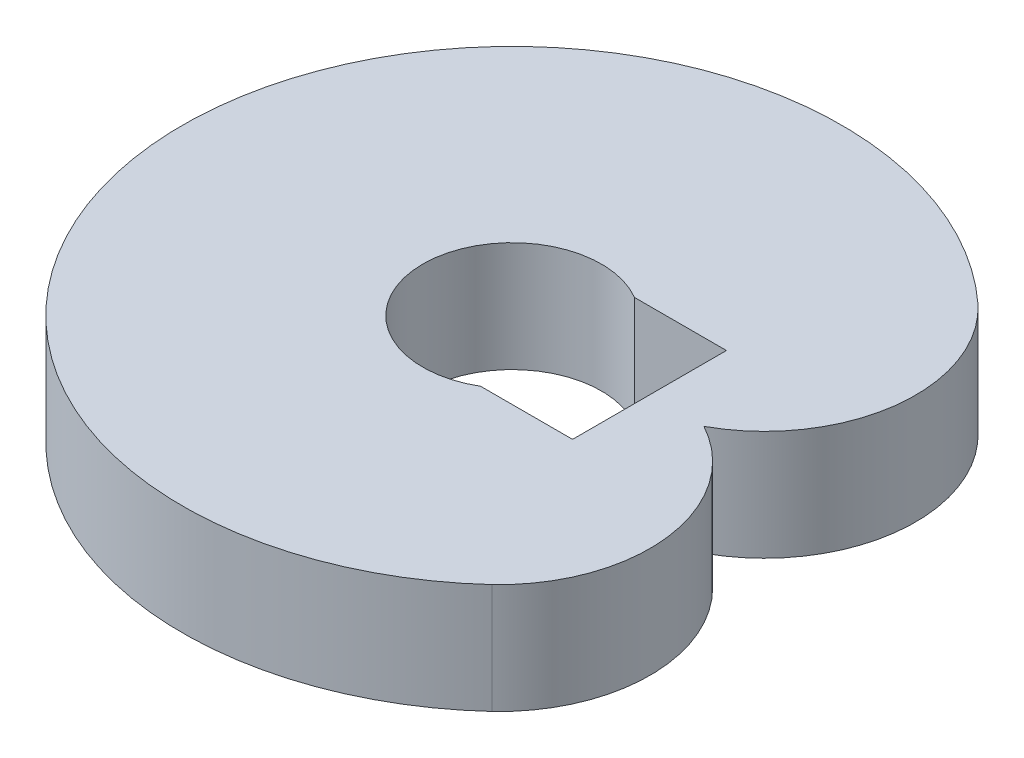
ISO-10303-21;
HEADER;
FILE_DESCRIPTION(('STEP AP214'),'2;1');
FILE_NAME('part.step','',(''),(''),'','','');
FILE_SCHEMA(('AUTOMOTIVE_DESIGN { 1 0 10303 214 1 1 1 1 }'));
ENDSEC;
DATA;
#1=APPLICATION_CONTEXT('core data for automotive mechanical design processes');
#2=APPLICATION_PROTOCOL_DEFINITION('international standard','automotive_design',2000,#1);
#3=PRODUCT_CONTEXT('',#1,'mechanical');
#4=PRODUCT('Part','Part','',(#3));
#5=PRODUCT_RELATED_PRODUCT_CATEGORY('part','',(#4));
#6=PRODUCT_DEFINITION_FORMATION('','',#4);
#7=PRODUCT_DEFINITION_CONTEXT('part definition',#1,'design');
#8=PRODUCT_DEFINITION('design','',#6,#7);
#9=PRODUCT_DEFINITION_SHAPE('','',#8);
#10=(LENGTH_UNIT() NAMED_UNIT(*) SI_UNIT(.MILLI.,.METRE.));
#11=(NAMED_UNIT(*) PLANE_ANGLE_UNIT() SI_UNIT($,.RADIAN.));
#12=(NAMED_UNIT(*) SI_UNIT($,.STERADIAN.) SOLID_ANGLE_UNIT());
#13=UNCERTAINTY_MEASURE_WITH_UNIT(LENGTH_MEASURE(1.E-05),#10,'distance_accuracy_value','');
#14=(GEOMETRIC_REPRESENTATION_CONTEXT(3) GLOBAL_UNCERTAINTY_ASSIGNED_CONTEXT((#13)) GLOBAL_UNIT_ASSIGNED_CONTEXT((#10,
#11,#12)) REPRESENTATION_CONTEXT('',''));
#15=CARTESIAN_POINT('',(0.,0.,0.));
#16=DIRECTION('',(0.,0.,1.));
#17=DIRECTION('',(1.,0.,0.));
#18=AXIS2_PLACEMENT_3D('',#15,#16,#17);
#19=CARTESIAN_POINT('',(108.7337235333,0.,-120.7610341401));
#20=DIRECTION('',(0.,1.,0.));
#21=DIRECTION('',(0.,0.,1.));
#22=AXIS2_PLACEMENT_3D('',#19,#20,#21);
#23=PLANE('',#22);
#24=CARTESIAN_POINT('',(0.,0.,-1.110223024625E-13));
#25=DIRECTION('',(0.,1.,0.));
#26=DIRECTION('',(0.,0.,1.));
#27=AXIS2_PLACEMENT_3D('',#24,#25,#26);
#28=CIRCLE('',#27,600.);
#29=CARTESIAN_POINT('',(405.732526187912,0.,-442.019362916575));
#30=VERTEX_POINT('',#29);
#31=CARTESIAN_POINT('',(405.732526187905,0.,442.019362916582));
#32=VERTEX_POINT('',#31);
#33=EDGE_CURVE('E136',#30,#32,#28,.T.);
#34=ORIENTED_EDGE('',*,*,#33,.F.);
#35=CARTESIAN_POINT('',(217.4674470666,0.,-241.5220682802));
#36=DIRECTION('',(0.,1.,0.));
#37=DIRECTION('',(0.,0.,1.));
#38=AXIS2_PLACEMENT_3D('',#35,#36,#37);
#39=CIRCLE('',#38,275.0325529334);
#40=CARTESIAN_POINT('',(349.034903934634,0.,-8.54871728961371E-12));
#41=VERTEX_POINT('',#40);
#42=EDGE_CURVE('E139',#41,#30,#39,.T.);
#43=ORIENTED_EDGE('',*,*,#42,.F.);
#44=CARTESIAN_POINT('',(217.4674470666,0.,241.5220682802));
#45=DIRECTION('',(0.,1.,0.));
#46=DIRECTION('',(0.,0.,1.));
#47=AXIS2_PLACEMENT_3D('',#44,#45,#46);
#48=CIRCLE('',#47,275.0325529334);
#49=EDGE_CURVE('E141',#32,#41,#48,.T.);
#50=ORIENTED_EDGE('',*,*,#49,.F.);
#51=EDGE_LOOP('',(#34,#43,#50));
#52=FACE_BOUND('',#51,.T.);
#53=CARTESIAN_POINT('',(0.,0.,0.));
#54=DIRECTION('',(0.,1.,0.));
#55=DIRECTION('',(0.,0.,1.));
#56=AXIS2_PLACEMENT_3D('',#53,#54,#55);
#57=CIRCLE('',#56,162.6);
#58=CARTESIAN_POINT('',(82.6967955848363,0.,-140.));
#59=VERTEX_POINT('',#58);
#60=CARTESIAN_POINT('',(82.696795584836,0.,140.));
#61=VERTEX_POINT('',#60);
#62=EDGE_CURVE('E20',#59,#61,#57,.T.);
#63=ORIENTED_EDGE('',*,*,#62,.T.);
#64=DIRECTION('',(-1.,0.,0.));
#65=VECTOR('',#64,1.);
#66=CARTESIAN_POINT('',(82.69679558484,0.,140.));
#67=LINE('',#66,#65);
#68=CARTESIAN_POINT('',(250.,0.,140.));
#69=VERTEX_POINT('',#68);
#70=EDGE_CURVE('E96',#69,#61,#67,.T.);
#71=ORIENTED_EDGE('',*,*,#70,.F.);
#72=DIRECTION('',(0.,0.,1.));
#73=VECTOR('',#72,1.);
#74=CARTESIAN_POINT('',(250.,0.,140.));
#75=LINE('',#74,#73);
#76=CARTESIAN_POINT('',(250.,0.,-140.));
#77=VERTEX_POINT('',#76);
#78=EDGE_CURVE('E81',#77,#69,#75,.T.);
#79=ORIENTED_EDGE('',*,*,#78,.F.);
#80=DIRECTION('',(1.,0.,0.));
#81=VECTOR('',#80,1.);
#82=CARTESIAN_POINT('',(250.,0.,-140.));
#83=LINE('',#82,#81);
#84=EDGE_CURVE('E74',#59,#77,#83,.T.);
#85=ORIENTED_EDGE('',*,*,#84,.F.);
#86=EDGE_LOOP('',(#63,#71,#79,#85));
#87=FACE_BOUND('',#86,.T.);
#88=ADVANCED_FACE('F17',(#52,#87),#23,.F.);
#89=CARTESIAN_POINT('',(0.,200.,0.));
#90=DIRECTION('',(0.,1.,0.));
#91=DIRECTION('',(0.,0.,1.));
#92=AXIS2_PLACEMENT_3D('',#89,#90,#91);
#93=CYLINDRICAL_SURFACE('',#92,162.6);
#94=ORIENTED_EDGE('',*,*,#62,.F.);
#95=DIRECTION('',(0.,1.,0.));
#96=VECTOR('',#95,1.);
#97=CARTESIAN_POINT('',(82.6967955848376,200.,-140.));
#98=LINE('',#97,#96);
#99=CARTESIAN_POINT('',(82.6967955848363,200.,-140.));
#100=VERTEX_POINT('',#99);
#101=EDGE_CURVE('E119',#100,#59,#98,.F.);
#102=ORIENTED_EDGE('',*,*,#101,.F.);
#103=CARTESIAN_POINT('',(0.,200.,0.));
#104=DIRECTION('',(0.,1.,0.));
#105=DIRECTION('',(0.,0.,1.));
#106=AXIS2_PLACEMENT_3D('',#103,#104,#105);
#107=CIRCLE('',#106,162.6);
#108=CARTESIAN_POINT('',(82.696795584836,200.,140.));
#109=VERTEX_POINT('',#108);
#110=EDGE_CURVE('E109',#109,#100,#107,.F.);
#111=ORIENTED_EDGE('',*,*,#110,.F.);
#112=DIRECTION('',(0.,1.,0.));
#113=VECTOR('',#112,1.);
#114=CARTESIAN_POINT('',(82.6967955848369,200.,140.));
#115=LINE('',#114,#113);
#116=EDGE_CURVE('E102',#61,#109,#115,.T.);
#117=ORIENTED_EDGE('',*,*,#116,.F.);
#118=EDGE_LOOP('',(#94,#102,#111,#117));
#119=FACE_BOUND('',#118,.T.);
#120=ADVANCED_FACE('F164',(#119),#93,.F.);
#121=CARTESIAN_POINT('',(250.,200.,-140.));
#122=DIRECTION('',(0.,0.,1.));
#123=DIRECTION('',(1.,0.,0.));
#124=AXIS2_PLACEMENT_3D('',#121,#122,#123);
#125=PLANE('',#124);
#126=DIRECTION('',(0.,1.,0.));
#127=VECTOR('',#126,1.);
#128=CARTESIAN_POINT('',(250.,200.,-140.));
#129=LINE('',#128,#127);
#130=CARTESIAN_POINT('',(250.,200.,-140.));
#131=VERTEX_POINT('',#130);
#132=EDGE_CURVE('E85',#131,#77,#129,.F.);
#133=ORIENTED_EDGE('',*,*,#132,.F.);
#134=DIRECTION('',(1.,0.,0.));
#135=VECTOR('',#134,1.);
#136=CARTESIAN_POINT('',(108.7337235333,200.,-140.));
#137=LINE('',#136,#135);
#138=EDGE_CURVE('E107',#100,#131,#137,.T.);
#139=ORIENTED_EDGE('',*,*,#138,.F.);
#140=ORIENTED_EDGE('',*,*,#101,.T.);
#141=ORIENTED_EDGE('',*,*,#84,.T.);
#142=EDGE_LOOP('',(#133,#139,#140,#141));
#143=FACE_BOUND('',#142,.T.);
#144=ADVANCED_FACE('F165',(#143),#125,.T.);
#145=CARTESIAN_POINT('',(250.,200.,140.));
#146=DIRECTION('',(-1.,0.,0.));
#147=DIRECTION('',(0.,0.,1.));
#148=AXIS2_PLACEMENT_3D('',#145,#146,#147);
#149=PLANE('',#148);
#150=DIRECTION('',(0.,1.,0.));
#151=VECTOR('',#150,1.);
#152=CARTESIAN_POINT('',(250.,200.,140.));
#153=LINE('',#152,#151);
#154=CARTESIAN_POINT('',(250.,200.,140.));
#155=VERTEX_POINT('',#154);
#156=EDGE_CURVE('E88',#155,#69,#153,.F.);
#157=ORIENTED_EDGE('',*,*,#156,.F.);
#158=DIRECTION('',(0.,0.,1.));
#159=VECTOR('',#158,1.);
#160=CARTESIAN_POINT('',(250.,200.,-120.7610341401));
#161=LINE('',#160,#159);
#162=EDGE_CURVE('E92',#131,#155,#161,.T.);
#163=ORIENTED_EDGE('',*,*,#162,.F.);
#164=ORIENTED_EDGE('',*,*,#132,.T.);
#165=ORIENTED_EDGE('',*,*,#78,.T.);
#166=EDGE_LOOP('',(#157,#163,#164,#165));
#167=FACE_BOUND('',#166,.T.);
#168=ADVANCED_FACE('F90',(#167),#149,.T.);
#169=CARTESIAN_POINT('',(82.69679558484,200.,140.));
#170=DIRECTION('',(0.,0.,-1.));
#171=DIRECTION('',(-1.,0.,0.));
#172=AXIS2_PLACEMENT_3D('',#169,#170,#171);
#173=PLANE('',#172);
#174=ORIENTED_EDGE('',*,*,#116,.T.);
#175=DIRECTION('',(1.,0.,0.));
#176=VECTOR('',#175,1.);
#177=CARTESIAN_POINT('',(108.7337235333,200.,140.));
#178=LINE('',#177,#176);
#179=EDGE_CURVE('E100',#155,#109,#178,.F.);
#180=ORIENTED_EDGE('',*,*,#179,.F.);
#181=ORIENTED_EDGE('',*,*,#156,.T.);
#182=ORIENTED_EDGE('',*,*,#70,.T.);
#183=EDGE_LOOP('',(#174,#180,#181,#182));
#184=FACE_BOUND('',#183,.T.);
#185=ADVANCED_FACE('F101',(#184),#173,.T.);
#186=CARTESIAN_POINT('',(217.4674470666,200.,241.5220682802));
#187=DIRECTION('',(0.,1.,0.));
#188=DIRECTION('',(0.,0.,1.));
#189=AXIS2_PLACEMENT_3D('',#186,#187,#188);
#190=CYLINDRICAL_SURFACE('',#189,275.0325529334);
#191=DIRECTION('',(0.,1.,0.));
#192=VECTOR('',#191,1.);
#193=CARTESIAN_POINT('',(349.03490393465,200.,-1.7125190154843E-11));
#194=LINE('',#193,#192);
#195=CARTESIAN_POINT('',(349.034903934634,200.,-8.57647286522933E-12));
#196=VERTEX_POINT('',#195);
#197=EDGE_CURVE('E140',#196,#41,#194,.F.);
#198=ORIENTED_EDGE('',*,*,#197,.F.);
#199=CARTESIAN_POINT('',(217.4674470666,200.,241.5220682802));
#200=DIRECTION('',(0.,1.,0.));
#201=DIRECTION('',(0.,0.,1.));
#202=AXIS2_PLACEMENT_3D('',#199,#200,#201);
#203=CIRCLE('',#202,275.0325529334);
#204=CARTESIAN_POINT('',(405.732526187905,200.,442.019362916582));
#205=VERTEX_POINT('',#204);
#206=EDGE_CURVE('E104',#205,#196,#203,.T.);
#207=ORIENTED_EDGE('',*,*,#206,.F.);
#208=DIRECTION('',(0.,1.,0.));
#209=VECTOR('',#208,1.);
#210=CARTESIAN_POINT('',(405.732526187413,200.,442.019362917033));
#211=LINE('',#210,#209);
#212=EDGE_CURVE('E135',#32,#205,#211,.T.);
#213=ORIENTED_EDGE('',*,*,#212,.F.);
#214=ORIENTED_EDGE('',*,*,#49,.T.);
#215=EDGE_LOOP('',(#198,#207,#213,#214));
#216=FACE_BOUND('',#215,.T.);
#217=ADVANCED_FACE('F158',(#216),#190,.T.);
#218=CARTESIAN_POINT('',(217.4674470666,200.,-241.5220682802));
#219=DIRECTION('',(0.,1.,0.));
#220=DIRECTION('',(0.,0.,1.));
#221=AXIS2_PLACEMENT_3D('',#218,#219,#220);
#222=CYLINDRICAL_SURFACE('',#221,275.0325529334);
#223=DIRECTION('',(0.,1.,0.));
#224=VECTOR('',#223,1.);
#225=CARTESIAN_POINT('',(405.732526187437,200.,-442.019362917012));
#226=LINE('',#225,#224);
#227=CARTESIAN_POINT('',(405.732526187912,200.,-442.019362916575));
#228=VERTEX_POINT('',#227);
#229=EDGE_CURVE('E36',#228,#30,#226,.F.);
#230=ORIENTED_EDGE('',*,*,#229,.F.);
#231=CARTESIAN_POINT('',(217.4674470666,200.,-241.5220682802));
#232=DIRECTION('',(0.,1.,0.));
#233=DIRECTION('',(0.,0.,1.));
#234=AXIS2_PLACEMENT_3D('',#231,#232,#233);
#235=CIRCLE('',#234,275.0325529334);
#236=EDGE_CURVE('E27',#196,#228,#235,.T.);
#237=ORIENTED_EDGE('',*,*,#236,.F.);
#238=ORIENTED_EDGE('',*,*,#197,.T.);
#239=ORIENTED_EDGE('',*,*,#42,.T.);
#240=EDGE_LOOP('',(#230,#237,#238,#239));
#241=FACE_BOUND('',#240,.T.);
#242=ADVANCED_FACE('F160',(#241),#222,.T.);
#243=CARTESIAN_POINT('',(0.,200.,-1.110223024625E-13));
#244=DIRECTION('',(0.,1.,0.));
#245=DIRECTION('',(0.,0.,1.));
#246=AXIS2_PLACEMENT_3D('',#243,#244,#245);
#247=CYLINDRICAL_SURFACE('',#246,600.);
#248=ORIENTED_EDGE('',*,*,#212,.T.);
#249=CARTESIAN_POINT('',(0.,200.,-1.110223024625E-13));
#250=DIRECTION('',(0.,1.,0.));
#251=DIRECTION('',(0.,0.,1.));
#252=AXIS2_PLACEMENT_3D('',#249,#250,#251);
#253=CIRCLE('',#252,600.);
#254=EDGE_CURVE('E11',#228,#205,#253,.T.);
#255=ORIENTED_EDGE('',*,*,#254,.F.);
#256=ORIENTED_EDGE('',*,*,#229,.T.);
#257=ORIENTED_EDGE('',*,*,#33,.T.);
#258=EDGE_LOOP('',(#248,#255,#256,#257));
#259=FACE_BOUND('',#258,.T.);
#260=ADVANCED_FACE('F156',(#259),#247,.T.);
#261=CARTESIAN_POINT('',(108.7337235333,200.,-120.7610341401));
#262=DIRECTION('',(0.,1.,0.));
#263=DIRECTION('',(0.,0.,1.));
#264=AXIS2_PLACEMENT_3D('',#261,#262,#263);
#265=PLANE('',#264);
#266=ORIENTED_EDGE('',*,*,#254,.T.);
#267=ORIENTED_EDGE('',*,*,#206,.T.);
#268=ORIENTED_EDGE('',*,*,#236,.T.);
#269=EDGE_LOOP('',(#266,#267,#268));
#270=FACE_BOUND('',#269,.T.);
#271=ORIENTED_EDGE('',*,*,#162,.T.);
#272=ORIENTED_EDGE('',*,*,#179,.T.);
#273=ORIENTED_EDGE('',*,*,#110,.T.);
#274=ORIENTED_EDGE('',*,*,#138,.T.);
#275=EDGE_LOOP('',(#271,#272,#273,#274));
#276=FACE_BOUND('',#275,.T.);
#277=ADVANCED_FACE('F106',(#270,#276),#265,.T.);
#278=CLOSED_SHELL('',(#88,#120,#144,#168,#185,#217,#242,#260,#277));
#279=MANIFOLD_SOLID_BREP('B1',#278);
#280=ADVANCED_BREP_SHAPE_REPRESENTATION('',(#18,#279),#14);
#281=SHAPE_DEFINITION_REPRESENTATION(#9,#280);
ENDSEC;
END-ISO-10303-21;
